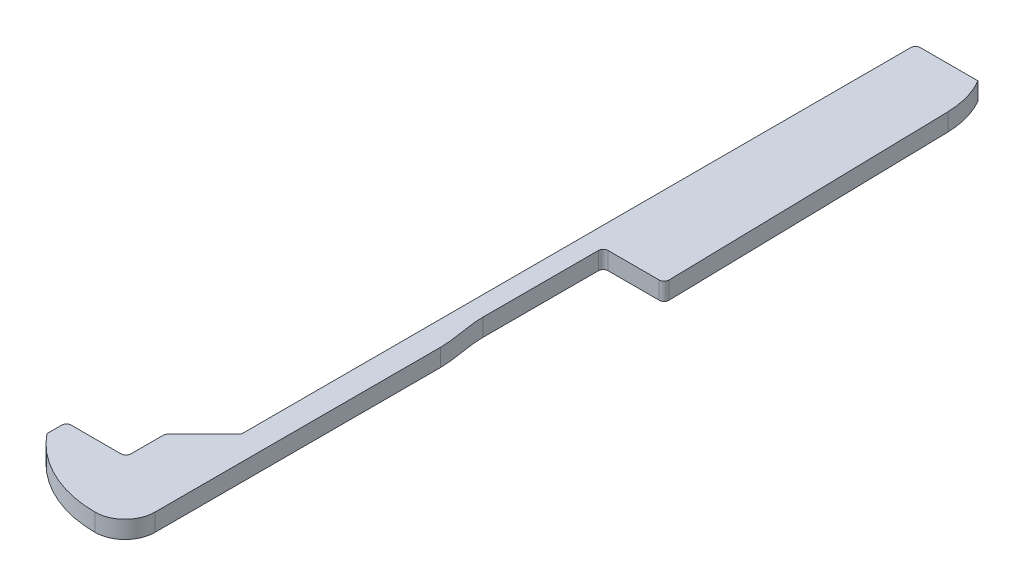
ISO-10303-21;
HEADER;
FILE_DESCRIPTION(('STEP AP214'),'2;1');
FILE_NAME('part.step','',(''),(''),'','','');
FILE_SCHEMA(('AUTOMOTIVE_DESIGN { 1 0 10303 214 1 1 1 1 }'));
ENDSEC;
DATA;
#1=APPLICATION_CONTEXT('core data for automotive mechanical design processes');
#2=APPLICATION_PROTOCOL_DEFINITION('international standard','automotive_design',2000,#1);
#3=PRODUCT_CONTEXT('',#1,'mechanical');
#4=PRODUCT('Part','Part','',(#3));
#5=PRODUCT_RELATED_PRODUCT_CATEGORY('part','',(#4));
#6=PRODUCT_DEFINITION_FORMATION('','',#4);
#7=PRODUCT_DEFINITION_CONTEXT('part definition',#1,'design');
#8=PRODUCT_DEFINITION('design','',#6,#7);
#9=PRODUCT_DEFINITION_SHAPE('','',#8);
#10=(LENGTH_UNIT() NAMED_UNIT(*) SI_UNIT(.MILLI.,.METRE.));
#11=(NAMED_UNIT(*) PLANE_ANGLE_UNIT() SI_UNIT($,.RADIAN.));
#12=(NAMED_UNIT(*) SI_UNIT($,.STERADIAN.) SOLID_ANGLE_UNIT());
#13=UNCERTAINTY_MEASURE_WITH_UNIT(LENGTH_MEASURE(1.E-05),#10,'distance_accuracy_value','');
#14=(GEOMETRIC_REPRESENTATION_CONTEXT(3) GLOBAL_UNCERTAINTY_ASSIGNED_CONTEXT((#13)) GLOBAL_UNIT_ASSIGNED_CONTEXT((#10,
#11,#12)) REPRESENTATION_CONTEXT('',''));
#15=CARTESIAN_POINT('',(0.,0.,0.));
#16=DIRECTION('',(0.,0.,1.));
#17=DIRECTION('',(1.,0.,0.));
#18=AXIS2_PLACEMENT_3D('',#15,#16,#17);
#19=CARTESIAN_POINT('',(9.43,1.8,-12.1305444444443));
#20=DIRECTION('',(0.,-1.,0.));
#21=DIRECTION('',(0.,0.,-1.));
#22=AXIS2_PLACEMENT_3D('',#19,#20,#21);
#23=CYLINDRICAL_SURFACE('',#22,12.1305444444443);
#24=CARTESIAN_POINT('',(9.43,0.,-12.1305444444443));
#25=DIRECTION('',(0.,1.,0.));
#26=DIRECTION('',(0.,0.,-1.));
#27=AXIS2_PLACEMENT_3D('',#24,#25,#26);
#28=CIRCLE('',#27,12.1305444444443);
#29=CARTESIAN_POINT('',(0.,0.,-4.5));
#30=VERTEX_POINT('',#29);
#31=CARTESIAN_POINT('',(9.43,0.,0.));
#32=VERTEX_POINT('',#31);
#33=EDGE_CURVE('E198',#30,#32,#28,.T.);
#34=ORIENTED_EDGE('',*,*,#33,.T.);
#35=DIRECTION('',(0.,-1.,0.));
#36=VECTOR('',#35,1.);
#37=CARTESIAN_POINT('',(9.43,1.8,0.));
#38=LINE('',#37,#36);
#39=CARTESIAN_POINT('',(9.43,1.8,0.));
#40=VERTEX_POINT('',#39);
#41=EDGE_CURVE('E180',#40,#32,#38,.T.);
#42=ORIENTED_EDGE('',*,*,#41,.F.);
#43=CARTESIAN_POINT('',(9.43,1.8,-12.1305444444443));
#44=DIRECTION('',(0.,1.,0.));
#45=DIRECTION('',(0.,0.,-1.));
#46=AXIS2_PLACEMENT_3D('',#43,#44,#45);
#47=CIRCLE('',#46,12.1305444444443);
#48=CARTESIAN_POINT('',(0.,1.8,-4.5));
#49=VERTEX_POINT('',#48);
#50=EDGE_CURVE('E186',#49,#40,#47,.T.);
#51=ORIENTED_EDGE('',*,*,#50,.F.);
#52=DIRECTION('',(0.,-1.,0.));
#53=VECTOR('',#52,1.);
#54=CARTESIAN_POINT('',(0.,1.8,-4.5));
#55=LINE('',#54,#53);
#56=EDGE_CURVE('E284',#49,#30,#55,.T.);
#57=ORIENTED_EDGE('',*,*,#56,.T.);
#58=EDGE_LOOP('',(#34,#42,#51,#57));
#59=FACE_BOUND('',#58,.T.);
#60=ADVANCED_FACE('F32',(#59),#23,.T.);
#61=CARTESIAN_POINT('',(9.43,1.8,-3.07));
#62=DIRECTION('',(0.,-1.,0.));
#63=DIRECTION('',(0.,0.,-1.));
#64=AXIS2_PLACEMENT_3D('',#61,#62,#63);
#65=CYLINDRICAL_SURFACE('',#64,3.07);
#66=CARTESIAN_POINT('',(9.43,0.,-3.07));
#67=DIRECTION('',(0.,1.,0.));
#68=DIRECTION('',(0.,0.,-1.));
#69=AXIS2_PLACEMENT_3D('',#66,#67,#68);
#70=CIRCLE('',#69,3.07);
#71=CARTESIAN_POINT('',(12.5,0.,-3.07));
#72=VERTEX_POINT('',#71);
#73=EDGE_CURVE('E291',#32,#72,#70,.T.);
#74=ORIENTED_EDGE('',*,*,#73,.T.);
#75=DIRECTION('',(0.,-1.,0.));
#76=VECTOR('',#75,1.);
#77=CARTESIAN_POINT('',(12.5,1.8,-3.07));
#78=LINE('',#77,#76);
#79=CARTESIAN_POINT('',(12.5,1.8,-3.07));
#80=VERTEX_POINT('',#79);
#81=EDGE_CURVE('E183',#80,#72,#78,.T.);
#82=ORIENTED_EDGE('',*,*,#81,.F.);
#83=CARTESIAN_POINT('',(9.43,1.8,-3.07));
#84=DIRECTION('',(0.,1.,0.));
#85=DIRECTION('',(0.,0.,-1.));
#86=AXIS2_PLACEMENT_3D('',#83,#84,#85);
#87=CIRCLE('',#86,3.07);
#88=EDGE_CURVE('E176',#40,#80,#87,.T.);
#89=ORIENTED_EDGE('',*,*,#88,.F.);
#90=ORIENTED_EDGE('',*,*,#41,.T.);
#91=EDGE_LOOP('',(#74,#82,#89,#90));
#92=FACE_BOUND('',#91,.T.);
#93=ADVANCED_FACE('F178',(#92),#65,.T.);
#94=CARTESIAN_POINT('',(12.5,1.8,-32.33));
#95=DIRECTION('',(-1.,0.,0.));
#96=DIRECTION('',(0.,0.,1.));
#97=AXIS2_PLACEMENT_3D('',#94,#95,#96);
#98=PLANE('',#97);
#99=DIRECTION('',(0.,0.,-1.));
#100=VECTOR('',#99,1.);
#101=CARTESIAN_POINT('',(12.5,0.,-32.33));
#102=LINE('',#101,#100);
#103=CARTESIAN_POINT('',(12.5,0.,-32.33));
#104=VERTEX_POINT('',#103);
#105=EDGE_CURVE('E293',#72,#104,#102,.T.);
#106=ORIENTED_EDGE('',*,*,#105,.T.);
#107=DIRECTION('',(0.,-1.,0.));
#108=VECTOR('',#107,1.);
#109=CARTESIAN_POINT('',(12.5,1.8,-32.33));
#110=LINE('',#109,#108);
#111=CARTESIAN_POINT('',(12.5,1.8,-32.33));
#112=VERTEX_POINT('',#111);
#113=EDGE_CURVE('E203',#112,#104,#110,.T.);
#114=ORIENTED_EDGE('',*,*,#113,.F.);
#115=DIRECTION('',(0.,0.,-1.));
#116=VECTOR('',#115,1.);
#117=CARTESIAN_POINT('',(12.5,1.8,-32.33));
#118=LINE('',#117,#116);
#119=EDGE_CURVE('E185',#80,#112,#118,.T.);
#120=ORIENTED_EDGE('',*,*,#119,.F.);
#121=ORIENTED_EDGE('',*,*,#81,.T.);
#122=EDGE_LOOP('',(#106,#114,#120,#121));
#123=FACE_BOUND('',#122,.T.);
#124=ADVANCED_FACE('F424',(#123),#98,.F.);
#125=CARTESIAN_POINT('',(12.5,1.8,-32.33));
#126=CARTESIAN_POINT('',(12.5,1.8,-33.9722823380889));
#127=CARTESIAN_POINT('',(12.,1.8,-35.554764974261));
#128=CARTESIAN_POINT('',(12.,1.8,-37.18));
#129=B_SPLINE_CURVE_WITH_KNOTS('',3,(#125,#126,#127,#128),.UNSPECIFIED.,.F.,.F.,(4,4),(0.,1.),.UNSPECIFIED.);
#130=DIRECTION('',(0.,-1.,0.));
#131=VECTOR('',#130,1.);
#132=SURFACE_OF_LINEAR_EXTRUSION('',#129,#131);
#133=CARTESIAN_POINT('',(12.5,0.,-32.33));
#134=CARTESIAN_POINT('',(12.5,0.,-33.9722823380889));
#135=CARTESIAN_POINT('',(12.,0.,-35.554764974261));
#136=CARTESIAN_POINT('',(12.,0.,-37.18));
#137=B_SPLINE_CURVE_WITH_KNOTS('',3,(#133,#134,#135,#136),.UNSPECIFIED.,.F.,.F.,(4,4),(0.,1.),.UNSPECIFIED.);
#138=CARTESIAN_POINT('',(12.,0.,-37.18));
#139=VERTEX_POINT('',#138);
#140=EDGE_CURVE('E295',#104,#139,#137,.T.);
#141=ORIENTED_EDGE('',*,*,#140,.T.);
#142=DIRECTION('',(0.,-1.,0.));
#143=VECTOR('',#142,1.);
#144=CARTESIAN_POINT('',(12.,1.8,-37.18));
#145=LINE('',#144,#143);
#146=CARTESIAN_POINT('',(12.,1.8,-37.18));
#147=VERTEX_POINT('',#146);
#148=EDGE_CURVE('E329',#147,#139,#145,.T.);
#149=ORIENTED_EDGE('',*,*,#148,.F.);
#150=EDGE_CURVE('E338',#112,#147,#129,.T.);
#151=ORIENTED_EDGE('',*,*,#150,.F.);
#152=ORIENTED_EDGE('',*,*,#113,.T.);
#153=EDGE_LOOP('',(#141,#149,#151,#152));
#154=FACE_BOUND('',#153,.T.);
#155=ADVANCED_FACE('F336',(#154),#132,.F.);
#156=CARTESIAN_POINT('',(12.,1.8,-37.18));
#157=DIRECTION('',(-1.,0.,0.));
#158=DIRECTION('',(0.,0.,1.));
#159=AXIS2_PLACEMENT_3D('',#156,#157,#158);
#160=PLANE('',#159);
#161=DIRECTION('',(0.,0.,-1.));
#162=VECTOR('',#161,1.);
#163=CARTESIAN_POINT('',(12.,0.,-37.18));
#164=LINE('',#163,#162);
#165=CARTESIAN_POINT('',(12.,0.,-49.));
#166=VERTEX_POINT('',#165);
#167=EDGE_CURVE('E299',#139,#166,#164,.T.);
#168=ORIENTED_EDGE('',*,*,#167,.T.);
#169=DIRECTION('',(0.,-1.,0.));
#170=VECTOR('',#169,1.);
#171=CARTESIAN_POINT('',(12.,1.8,-49.));
#172=LINE('',#171,#170);
#173=CARTESIAN_POINT('',(12.,1.8,-49.));
#174=VERTEX_POINT('',#173);
#175=EDGE_CURVE('E209',#166,#174,#172,.F.);
#176=ORIENTED_EDGE('',*,*,#175,.T.);
#177=DIRECTION('',(0.,0.,-1.));
#178=VECTOR('',#177,1.);
#179=CARTESIAN_POINT('',(12.,1.8,-37.18));
#180=LINE('',#179,#178);
#181=EDGE_CURVE('E355',#147,#174,#180,.T.);
#182=ORIENTED_EDGE('',*,*,#181,.F.);
#183=ORIENTED_EDGE('',*,*,#148,.T.);
#184=EDGE_LOOP('',(#168,#176,#182,#183));
#185=FACE_BOUND('',#184,.T.);
#186=ADVANCED_FACE('F345',(#185),#160,.F.);
#187=CARTESIAN_POINT('',(18.25,1.8,-49.5));
#188=DIRECTION('',(0.,0.,-1.));
#189=DIRECTION('',(-1.,0.,0.));
#190=AXIS2_PLACEMENT_3D('',#187,#188,#189);
#191=PLANE('',#190);
#192=DIRECTION('',(1.,0.,0.));
#193=VECTOR('',#192,1.);
#194=CARTESIAN_POINT('',(18.25,1.8,-49.5));
#195=LINE('',#194,#193);
#196=CARTESIAN_POINT('',(12.5,1.8,-49.5));
#197=VERTEX_POINT('',#196);
#198=CARTESIAN_POINT('',(17.7389709464066,1.8,-49.5));
#199=VERTEX_POINT('',#198);
#200=EDGE_CURVE('E353',#197,#199,#195,.T.);
#201=ORIENTED_EDGE('',*,*,#200,.F.);
#202=DIRECTION('',(0.,-1.,0.));
#203=VECTOR('',#202,1.);
#204=CARTESIAN_POINT('',(12.5,0.,-49.5));
#205=LINE('',#204,#203);
#206=CARTESIAN_POINT('',(12.5,0.,-49.5));
#207=VERTEX_POINT('',#206);
#208=EDGE_CURVE('E201',#197,#207,#205,.T.);
#209=ORIENTED_EDGE('',*,*,#208,.T.);
#210=DIRECTION('',(1.,0.,0.));
#211=VECTOR('',#210,1.);
#212=CARTESIAN_POINT('',(18.25,0.,-49.5));
#213=LINE('',#212,#211);
#214=CARTESIAN_POINT('',(17.7389709464066,0.,-49.5));
#215=VERTEX_POINT('',#214);
#216=EDGE_CURVE('E305',#207,#215,#213,.T.);
#217=ORIENTED_EDGE('',*,*,#216,.T.);
#218=DIRECTION('',(0.,-1.,0.));
#219=VECTOR('',#218,1.);
#220=CARTESIAN_POINT('',(17.7389709464066,1.8,-49.5));
#221=LINE('',#220,#219);
#222=EDGE_CURVE('E199',#215,#199,#221,.F.);
#223=ORIENTED_EDGE('',*,*,#222,.T.);
#224=EDGE_LOOP('',(#201,#209,#217,#223));
#225=FACE_BOUND('',#224,.T.);
#226=ADVANCED_FACE('F357',(#225),#191,.F.);
#227=CARTESIAN_POINT('',(17.6019605823982,1.8,-79.1992260441899));
#228=DIRECTION('',(-0.999762027079909,0.,0.0218148850345542));
#229=DIRECTION('',(0.0218148850345542,0.,0.999762027079909));
#230=AXIS2_PLACEMENT_3D('',#227,#228,#229);
#231=PLANE('',#230);
#232=DIRECTION('',(-0.0218148850345542,0.,-0.999762027079909));
#233=VECTOR('',#232,1.);
#234=CARTESIAN_POINT('',(17.6019605823982,1.8,-79.1992260441899));
#235=LINE('',#234,#233);
#236=CARTESIAN_POINT('',(18.2388519599465,1.8,-50.0109074425173));
#237=VERTEX_POINT('',#236);
#238=CARTESIAN_POINT('',(17.6019605823982,1.8,-79.1992260441899));
#239=VERTEX_POINT('',#238);
#240=EDGE_CURVE('E359',#237,#239,#235,.T.);
#241=ORIENTED_EDGE('',*,*,#240,.F.);
#242=DIRECTION('',(0.,-1.,0.));
#243=VECTOR('',#242,1.);
#244=CARTESIAN_POINT('',(18.2388519599465,1.8,-50.0109074425173));
#245=LINE('',#244,#243);
#246=CARTESIAN_POINT('',(18.2388519599465,0.,-50.0109074425173));
#247=VERTEX_POINT('',#246);
#248=EDGE_CURVE('E211',#237,#247,#245,.T.);
#249=ORIENTED_EDGE('',*,*,#248,.T.);
#250=DIRECTION('',(-0.0218148850345542,0.,-0.999762027079909));
#251=VECTOR('',#250,1.);
#252=CARTESIAN_POINT('',(17.6019605823982,0.,-79.1992260441899));
#253=LINE('',#252,#251);
#254=CARTESIAN_POINT('',(17.6019605823982,0.,-79.1992260441899));
#255=VERTEX_POINT('',#254);
#256=EDGE_CURVE('E308',#247,#255,#253,.T.);
#257=ORIENTED_EDGE('',*,*,#256,.T.);
#258=DIRECTION('',(0.,-1.,0.));
#259=VECTOR('',#258,1.);
#260=CARTESIAN_POINT('',(17.6019605823982,1.8,-79.1992260441899));
#261=LINE('',#260,#259);
#262=EDGE_CURVE('E326',#239,#255,#261,.T.);
#263=ORIENTED_EDGE('',*,*,#262,.F.);
#264=EDGE_LOOP('',(#241,#249,#257,#263));
#265=FACE_BOUND('',#264,.T.);
#266=ADVANCED_FACE('F407',(#265),#231,.F.);
#267=CARTESIAN_POINT('',(8.60410233867904,1.8,-79.0028920788789));
#268=DIRECTION('',(0.,-1.,0.));
#269=DIRECTION('',(0.,0.,-1.));
#270=AXIS2_PLACEMENT_3D('',#267,#268,#269);
#271=CYLINDRICAL_SURFACE('',#270,9.);
#272=CARTESIAN_POINT('',(8.60410233867904,0.,-79.0028920788789));
#273=DIRECTION('',(0.,1.,0.));
#274=DIRECTION('',(0.,0.,1.));
#275=AXIS2_PLACEMENT_3D('',#272,#273,#274);
#276=CIRCLE('',#275,9.);
#277=CARTESIAN_POINT('',(16.4,0.,-83.5));
#278=VERTEX_POINT('',#277);
#279=EDGE_CURVE('E310',#255,#278,#276,.T.);
#280=ORIENTED_EDGE('',*,*,#279,.T.);
#281=DIRECTION('',(0.,-1.,0.));
#282=VECTOR('',#281,1.);
#283=CARTESIAN_POINT('',(16.4,1.8,-83.5));
#284=LINE('',#283,#282);
#285=CARTESIAN_POINT('',(16.4,1.8,-83.5));
#286=VERTEX_POINT('',#285);
#287=EDGE_CURVE('E323',#286,#278,#284,.T.);
#288=ORIENTED_EDGE('',*,*,#287,.F.);
#289=CARTESIAN_POINT('',(8.60410233867904,1.8,-79.0028920788789));
#290=DIRECTION('',(0.,1.,0.));
#291=DIRECTION('',(0.,0.,1.));
#292=AXIS2_PLACEMENT_3D('',#289,#290,#291);
#293=CIRCLE('',#292,9.);
#294=EDGE_CURVE('E361',#239,#286,#293,.T.);
#295=ORIENTED_EDGE('',*,*,#294,.F.);
#296=ORIENTED_EDGE('',*,*,#262,.T.);
#297=EDGE_LOOP('',(#280,#288,#295,#296));
#298=FACE_BOUND('',#297,.T.);
#299=ADVANCED_FACE('F403',(#298),#271,.T.);
#300=CARTESIAN_POINT('',(10.,1.8,-83.5));
#301=DIRECTION('',(0.,0.,1.));
#302=DIRECTION('',(1.,0.,0.));
#303=AXIS2_PLACEMENT_3D('',#300,#301,#302);
#304=PLANE('',#303);
#305=DIRECTION('',(-1.,0.,0.));
#306=VECTOR('',#305,1.);
#307=CARTESIAN_POINT('',(10.,0.,-83.5));
#308=LINE('',#307,#306);
#309=CARTESIAN_POINT('',(10.5,0.,-83.5));
#310=VERTEX_POINT('',#309);
#311=EDGE_CURVE('E312',#278,#310,#308,.T.);
#312=ORIENTED_EDGE('',*,*,#311,.T.);
#313=DIRECTION('',(0.,-1.,0.));
#314=VECTOR('',#313,1.);
#315=CARTESIAN_POINT('',(10.5,1.8,-83.5));
#316=LINE('',#315,#314);
#317=CARTESIAN_POINT('',(10.5,1.8,-83.5));
#318=VERTEX_POINT('',#317);
#319=EDGE_CURVE('E248',#310,#318,#316,.F.);
#320=ORIENTED_EDGE('',*,*,#319,.T.);
#321=DIRECTION('',(-1.,0.,0.));
#322=VECTOR('',#321,1.);
#323=CARTESIAN_POINT('',(10.,1.8,-83.5));
#324=LINE('',#323,#322);
#325=EDGE_CURVE('E367',#286,#318,#324,.T.);
#326=ORIENTED_EDGE('',*,*,#325,.F.);
#327=ORIENTED_EDGE('',*,*,#287,.T.);
#328=EDGE_LOOP('',(#312,#320,#326,#327));
#329=FACE_BOUND('',#328,.T.);
#330=ADVANCED_FACE('F398',(#329),#304,.F.);
#331=CARTESIAN_POINT('',(10.,1.8,-14.4));
#332=DIRECTION('',(1.,0.,0.));
#333=DIRECTION('',(0.,0.,-1.));
#334=AXIS2_PLACEMENT_3D('',#331,#332,#333);
#335=PLANE('',#334);
#336=DIRECTION('',(0.,0.,1.));
#337=VECTOR('',#336,1.);
#338=CARTESIAN_POINT('',(10.,0.,-14.4));
#339=LINE('',#338,#337);
#340=CARTESIAN_POINT('',(10.,0.,-83.));
#341=VERTEX_POINT('',#340);
#342=CARTESIAN_POINT('',(10.,0.,-14.6071067811865));
#343=VERTEX_POINT('',#342);
#344=EDGE_CURVE('E315',#341,#343,#339,.T.);
#345=ORIENTED_EDGE('',*,*,#344,.T.);
#346=DIRECTION('',(0.,-1.,0.));
#347=VECTOR('',#346,1.);
#348=CARTESIAN_POINT('',(10.,1.8,-14.6071067811865));
#349=LINE('',#348,#347);
#350=CARTESIAN_POINT('',(10.,1.8,-14.6071067811865));
#351=VERTEX_POINT('',#350);
#352=EDGE_CURVE('E237',#343,#351,#349,.F.);
#353=ORIENTED_EDGE('',*,*,#352,.T.);
#354=DIRECTION('',(0.,0.,1.));
#355=VECTOR('',#354,1.);
#356=CARTESIAN_POINT('',(10.,1.8,-14.4));
#357=LINE('',#356,#355);
#358=CARTESIAN_POINT('',(10.,1.8,-83.));
#359=VERTEX_POINT('',#358);
#360=EDGE_CURVE('E370',#359,#351,#357,.T.);
#361=ORIENTED_EDGE('',*,*,#360,.F.);
#362=DIRECTION('',(0.,-1.,0.));
#363=VECTOR('',#362,1.);
#364=CARTESIAN_POINT('',(10.,1.8,-83.));
#365=LINE('',#364,#363);
#366=EDGE_CURVE('E234',#359,#341,#365,.T.);
#367=ORIENTED_EDGE('',*,*,#366,.T.);
#368=EDGE_LOOP('',(#345,#353,#361,#367));
#369=FACE_BOUND('',#368,.T.);
#370=ADVANCED_FACE('F388',(#369),#335,.F.);
#371=CARTESIAN_POINT('',(6.1,1.8,-10.5));
#372=DIRECTION('',(0.707106781186546,0.,0.707106781186549));
#373=DIRECTION('',(0.707106781186549,0.,-0.707106781186546));
#374=AXIS2_PLACEMENT_3D('',#371,#372,#373);
#375=PLANE('',#374);
#376=DIRECTION('',(-0.707106781186549,0.,0.707106781186546));
#377=VECTOR('',#376,1.);
#378=CARTESIAN_POINT('',(6.1,1.8,-10.5));
#379=LINE('',#378,#377);
#380=CARTESIAN_POINT('',(9.85355339059327,1.8,-14.2535533905933));
#381=VERTEX_POINT('',#380);
#382=CARTESIAN_POINT('',(6.24644660940673,1.8,-10.6464466094067));
#383=VERTEX_POINT('',#382);
#384=EDGE_CURVE('E286',#381,#383,#379,.T.);
#385=ORIENTED_EDGE('',*,*,#384,.F.);
#386=DIRECTION('',(0.,-1.,0.));
#387=VECTOR('',#386,1.);
#388=CARTESIAN_POINT('',(9.85355339059327,0.,-14.2535533905933));
#389=LINE('',#388,#387);
#390=CARTESIAN_POINT('',(9.85355339059327,0.,-14.2535533905933));
#391=VERTEX_POINT('',#390);
#392=EDGE_CURVE('E231',#381,#391,#389,.T.);
#393=ORIENTED_EDGE('',*,*,#392,.T.);
#394=DIRECTION('',(-0.707106781186549,0.,0.707106781186546));
#395=VECTOR('',#394,1.);
#396=CARTESIAN_POINT('',(6.1,0.,-10.5));
#397=LINE('',#396,#395);
#398=CARTESIAN_POINT('',(6.24644660940673,0.,-10.6464466094067));
#399=VERTEX_POINT('',#398);
#400=EDGE_CURVE('E276',#391,#399,#397,.T.);
#401=ORIENTED_EDGE('',*,*,#400,.T.);
#402=DIRECTION('',(0.,-1.,0.));
#403=VECTOR('',#402,1.);
#404=CARTESIAN_POINT('',(6.24644660940673,1.8,-10.6464466094067));
#405=LINE('',#404,#403);
#406=EDGE_CURVE('E229',#399,#383,#405,.F.);
#407=ORIENTED_EDGE('',*,*,#406,.T.);
#408=EDGE_LOOP('',(#385,#393,#401,#407));
#409=FACE_BOUND('',#408,.T.);
#410=ADVANCED_FACE('F382',(#409),#375,.F.);
#411=CARTESIAN_POINT('',(6.1,1.8,-6.5));
#412=DIRECTION('',(1.,0.,0.));
#413=DIRECTION('',(0.,0.,-1.));
#414=AXIS2_PLACEMENT_3D('',#411,#412,#413);
#415=PLANE('',#414);
#416=DIRECTION('',(0.,0.,1.));
#417=VECTOR('',#416,1.);
#418=CARTESIAN_POINT('',(6.1,1.8,-6.5));
#419=LINE('',#418,#417);
#420=CARTESIAN_POINT('',(6.1,1.8,-10.2928932188135));
#421=VERTEX_POINT('',#420);
#422=CARTESIAN_POINT('',(6.1,1.8,-7.));
#423=VERTEX_POINT('',#422);
#424=EDGE_CURVE('E281',#421,#423,#419,.T.);
#425=ORIENTED_EDGE('',*,*,#424,.F.);
#426=DIRECTION('',(0.,-1.,0.));
#427=VECTOR('',#426,1.);
#428=CARTESIAN_POINT('',(6.1,1.8,-10.2928932188135));
#429=LINE('',#428,#427);
#430=CARTESIAN_POINT('',(6.1,0.,-10.2928932188135));
#431=VERTEX_POINT('',#430);
#432=EDGE_CURVE('E241',#421,#431,#429,.T.);
#433=ORIENTED_EDGE('',*,*,#432,.T.);
#434=DIRECTION('',(0.,0.,1.));
#435=VECTOR('',#434,1.);
#436=CARTESIAN_POINT('',(6.1,0.,-6.5));
#437=LINE('',#436,#435);
#438=CARTESIAN_POINT('',(6.1,0.,-7.));
#439=VERTEX_POINT('',#438);
#440=EDGE_CURVE('E266',#431,#439,#437,.T.);
#441=ORIENTED_EDGE('',*,*,#440,.T.);
#442=DIRECTION('',(0.,-1.,0.));
#443=VECTOR('',#442,1.);
#444=CARTESIAN_POINT('',(6.1,1.8,-7.));
#445=LINE('',#444,#443);
#446=EDGE_CURVE('E239',#439,#423,#445,.F.);
#447=ORIENTED_EDGE('',*,*,#446,.T.);
#448=EDGE_LOOP('',(#425,#433,#441,#447));
#449=FACE_BOUND('',#448,.T.);
#450=ADVANCED_FACE('F273',(#449),#415,.F.);
#451=CARTESIAN_POINT('',(0.,1.8,-6.5));
#452=DIRECTION('',(0.,0.,1.));
#453=DIRECTION('',(1.,0.,0.));
#454=AXIS2_PLACEMENT_3D('',#451,#452,#453);
#455=PLANE('',#454);
#456=DIRECTION('',(-1.,0.,0.));
#457=VECTOR('',#456,1.);
#458=CARTESIAN_POINT('',(0.,1.8,-6.5));
#459=LINE('',#458,#457);
#460=CARTESIAN_POINT('',(5.6,1.8,-6.5));
#461=VERTEX_POINT('',#460);
#462=CARTESIAN_POINT('',(0.5,1.8,-6.5));
#463=VERTEX_POINT('',#462);
#464=EDGE_CURVE('E280',#461,#463,#459,.T.);
#465=ORIENTED_EDGE('',*,*,#464,.F.);
#466=DIRECTION('',(0.,-1.,0.));
#467=VECTOR('',#466,1.);
#468=CARTESIAN_POINT('',(5.6,0.,-6.5));
#469=LINE('',#468,#467);
#470=CARTESIAN_POINT('',(5.6,0.,-6.5));
#471=VERTEX_POINT('',#470);
#472=EDGE_CURVE('E245',#461,#471,#469,.T.);
#473=ORIENTED_EDGE('',*,*,#472,.T.);
#474=DIRECTION('',(-1.,0.,0.));
#475=VECTOR('',#474,1.);
#476=CARTESIAN_POINT('',(0.,0.,-6.5));
#477=LINE('',#476,#475);
#478=CARTESIAN_POINT('',(0.5,0.,-6.5));
#479=VERTEX_POINT('',#478);
#480=EDGE_CURVE('E267',#471,#479,#477,.T.);
#481=ORIENTED_EDGE('',*,*,#480,.T.);
#482=DIRECTION('',(0.,-1.,0.));
#483=VECTOR('',#482,1.);
#484=CARTESIAN_POINT('',(0.5,1.8,-6.5));
#485=LINE('',#484,#483);
#486=EDGE_CURVE('E55',#479,#463,#485,.F.);
#487=ORIENTED_EDGE('',*,*,#486,.T.);
#488=EDGE_LOOP('',(#465,#473,#481,#487));
#489=FACE_BOUND('',#488,.T.);
#490=ADVANCED_FACE('F282',(#489),#455,.F.);
#491=CARTESIAN_POINT('',(0.,1.8,-4.5));
#492=DIRECTION('',(1.,0.,0.));
#493=DIRECTION('',(0.,0.,-1.));
#494=AXIS2_PLACEMENT_3D('',#491,#492,#493);
#495=PLANE('',#494);
#496=DIRECTION('',(0.,0.,1.));
#497=VECTOR('',#496,1.);
#498=CARTESIAN_POINT('',(0.,1.8,-4.5));
#499=LINE('',#498,#497);
#500=CARTESIAN_POINT('',(0.,1.8,-6.));
#501=VERTEX_POINT('',#500);
#502=EDGE_CURVE('E191',#501,#49,#499,.T.);
#503=ORIENTED_EDGE('',*,*,#502,.F.);
#504=DIRECTION('',(0.,-1.,0.));
#505=VECTOR('',#504,1.);
#506=CARTESIAN_POINT('',(0.,1.8,-6.));
#507=LINE('',#506,#505);
#508=CARTESIAN_POINT('',(0.,0.,-6.));
#509=VERTEX_POINT('',#508);
#510=EDGE_CURVE('E250',#501,#509,#507,.T.);
#511=ORIENTED_EDGE('',*,*,#510,.T.);
#512=DIRECTION('',(0.,0.,1.));
#513=VECTOR('',#512,1.);
#514=CARTESIAN_POINT('',(0.,0.,-4.5));
#515=LINE('',#514,#513);
#516=EDGE_CURVE('E195',#509,#30,#515,.T.);
#517=ORIENTED_EDGE('',*,*,#516,.T.);
#518=ORIENTED_EDGE('',*,*,#56,.F.);
#519=EDGE_LOOP('',(#503,#511,#517,#518));
#520=FACE_BOUND('',#519,.T.);
#521=ADVANCED_FACE('F456',(#520),#495,.F.);
#522=CARTESIAN_POINT('',(9.43,1.8,-12.1305444444443));
#523=DIRECTION('',(0.,-1.,0.));
#524=DIRECTION('',(0.,0.,-1.));
#525=AXIS2_PLACEMENT_3D('',#522,#523,#524);
#526=PLANE('',#525);
#527=ORIENTED_EDGE('',*,*,#200,.T.);
#528=CARTESIAN_POINT('',(17.7389709464066,1.8,-50.));
#529=DIRECTION('',(0.,-1.,0.));
#530=DIRECTION('',(0.,0.,-1.));
#531=AXIS2_PLACEMENT_3D('',#528,#529,#530);
#532=CIRCLE('',#531,0.5);
#533=EDGE_CURVE('E227',#199,#237,#532,.F.);
#534=ORIENTED_EDGE('',*,*,#533,.T.);
#535=ORIENTED_EDGE('',*,*,#240,.T.);
#536=ORIENTED_EDGE('',*,*,#294,.T.);
#537=ORIENTED_EDGE('',*,*,#325,.T.);
#538=CARTESIAN_POINT('',(10.5,1.8,-83.));
#539=DIRECTION('',(0.,-1.,0.));
#540=DIRECTION('',(0.,0.,-1.));
#541=AXIS2_PLACEMENT_3D('',#538,#539,#540);
#542=CIRCLE('',#541,0.5);
#543=EDGE_CURVE('E223',#318,#359,#542,.F.);
#544=ORIENTED_EDGE('',*,*,#543,.T.);
#545=ORIENTED_EDGE('',*,*,#360,.T.);
#546=CARTESIAN_POINT('',(9.5,1.8,-14.6071067811865));
#547=DIRECTION('',(0.,-1.,0.));
#548=DIRECTION('',(0.,0.,-1.));
#549=AXIS2_PLACEMENT_3D('',#546,#547,#548);
#550=CIRCLE('',#549,0.5);
#551=EDGE_CURVE('E259',#351,#381,#550,.T.);
#552=ORIENTED_EDGE('',*,*,#551,.T.);
#553=ORIENTED_EDGE('',*,*,#384,.T.);
#554=CARTESIAN_POINT('',(6.6,1.8,-10.2928932188135));
#555=DIRECTION('',(0.,-1.,0.));
#556=DIRECTION('',(0.,0.,-1.));
#557=AXIS2_PLACEMENT_3D('',#554,#555,#556);
#558=CIRCLE('',#557,0.5);
#559=EDGE_CURVE('E225',#383,#421,#558,.F.);
#560=ORIENTED_EDGE('',*,*,#559,.T.);
#561=ORIENTED_EDGE('',*,*,#424,.T.);
#562=CARTESIAN_POINT('',(5.6,1.8,-7.));
#563=DIRECTION('',(0.,-1.,0.));
#564=DIRECTION('',(0.,0.,-1.));
#565=AXIS2_PLACEMENT_3D('',#562,#563,#564);
#566=CIRCLE('',#565,0.5);
#567=EDGE_CURVE('E11',#423,#461,#566,.T.);
#568=ORIENTED_EDGE('',*,*,#567,.T.);
#569=ORIENTED_EDGE('',*,*,#464,.T.);
#570=CARTESIAN_POINT('',(0.5,1.8,-6.));
#571=DIRECTION('',(0.,-1.,0.));
#572=DIRECTION('',(0.,0.,-1.));
#573=AXIS2_PLACEMENT_3D('',#570,#571,#572);
#574=CIRCLE('',#573,0.5);
#575=EDGE_CURVE('E47',#463,#501,#574,.F.);
#576=ORIENTED_EDGE('',*,*,#575,.T.);
#577=ORIENTED_EDGE('',*,*,#502,.T.);
#578=ORIENTED_EDGE('',*,*,#50,.T.);
#579=ORIENTED_EDGE('',*,*,#88,.T.);
#580=ORIENTED_EDGE('',*,*,#119,.T.);
#581=ORIENTED_EDGE('',*,*,#150,.T.);
#582=ORIENTED_EDGE('',*,*,#181,.T.);
#583=CARTESIAN_POINT('',(12.5,1.8,-49.));
#584=DIRECTION('',(0.,-1.,0.));
#585=DIRECTION('',(0.,0.,-1.));
#586=AXIS2_PLACEMENT_3D('',#583,#584,#585);
#587=CIRCLE('',#586,0.5);
#588=EDGE_CURVE('E255',#174,#197,#587,.T.);
#589=ORIENTED_EDGE('',*,*,#588,.T.);
#590=EDGE_LOOP('',(#527,#534,#535,#536,#537,#544,#545,#552,#553,#560,#561,#568,#569,#576,#577,
#578,#579,#580,#581,#582,#589));
#591=FACE_BOUND('',#590,.T.);
#592=ADVANCED_FACE('F190',(#591),#526,.F.);
#593=CARTESIAN_POINT('',(9.43,0.,-12.1305444444443));
#594=DIRECTION('',(0.,-1.,0.));
#595=DIRECTION('',(0.,0.,-1.));
#596=AXIS2_PLACEMENT_3D('',#593,#594,#595);
#597=PLANE('',#596);
#598=ORIENTED_EDGE('',*,*,#256,.F.);
#599=CARTESIAN_POINT('',(17.7389709464066,0.,-50.));
#600=DIRECTION('',(0.,-1.,0.));
#601=DIRECTION('',(0.,0.,-1.));
#602=AXIS2_PLACEMENT_3D('',#599,#600,#601);
#603=CIRCLE('',#602,0.5);
#604=EDGE_CURVE('E220',#247,#215,#603,.T.);
#605=ORIENTED_EDGE('',*,*,#604,.T.);
#606=ORIENTED_EDGE('',*,*,#216,.F.);
#607=CARTESIAN_POINT('',(12.5,0.,-49.));
#608=DIRECTION('',(0.,-1.,0.));
#609=DIRECTION('',(0.,0.,-1.));
#610=AXIS2_PLACEMENT_3D('',#607,#608,#609);
#611=CIRCLE('',#610,0.5);
#612=EDGE_CURVE('E253',#207,#166,#611,.F.);
#613=ORIENTED_EDGE('',*,*,#612,.T.);
#614=ORIENTED_EDGE('',*,*,#167,.F.);
#615=ORIENTED_EDGE('',*,*,#140,.F.);
#616=ORIENTED_EDGE('',*,*,#105,.F.);
#617=ORIENTED_EDGE('',*,*,#73,.F.);
#618=ORIENTED_EDGE('',*,*,#33,.F.);
#619=ORIENTED_EDGE('',*,*,#516,.F.);
#620=CARTESIAN_POINT('',(0.5,0.,-6.));
#621=DIRECTION('',(0.,-1.,0.));
#622=DIRECTION('',(0.,0.,-1.));
#623=AXIS2_PLACEMENT_3D('',#620,#621,#622);
#624=CIRCLE('',#623,0.5);
#625=EDGE_CURVE('E214',#509,#479,#624,.T.);
#626=ORIENTED_EDGE('',*,*,#625,.T.);
#627=ORIENTED_EDGE('',*,*,#480,.F.);
#628=CARTESIAN_POINT('',(5.6,0.,-7.));
#629=DIRECTION('',(0.,-1.,0.));
#630=DIRECTION('',(0.,0.,-1.));
#631=AXIS2_PLACEMENT_3D('',#628,#629,#630);
#632=CIRCLE('',#631,0.5);
#633=EDGE_CURVE('E40',#471,#439,#632,.F.);
#634=ORIENTED_EDGE('',*,*,#633,.T.);
#635=ORIENTED_EDGE('',*,*,#440,.F.);
#636=CARTESIAN_POINT('',(6.6,0.,-10.2928932188135));
#637=DIRECTION('',(0.,-1.,0.));
#638=DIRECTION('',(0.,0.,-1.));
#639=AXIS2_PLACEMENT_3D('',#636,#637,#638);
#640=CIRCLE('',#639,0.5);
#641=EDGE_CURVE('E218',#431,#399,#640,.T.);
#642=ORIENTED_EDGE('',*,*,#641,.T.);
#643=ORIENTED_EDGE('',*,*,#400,.F.);
#644=CARTESIAN_POINT('',(9.5,0.,-14.6071067811865));
#645=DIRECTION('',(0.,-1.,0.));
#646=DIRECTION('',(0.,0.,-1.));
#647=AXIS2_PLACEMENT_3D('',#644,#645,#646);
#648=CIRCLE('',#647,0.5);
#649=EDGE_CURVE('E257',#391,#343,#648,.F.);
#650=ORIENTED_EDGE('',*,*,#649,.T.);
#651=ORIENTED_EDGE('',*,*,#344,.F.);
#652=CARTESIAN_POINT('',(10.5,0.,-83.));
#653=DIRECTION('',(0.,-1.,0.));
#654=DIRECTION('',(0.,0.,-1.));
#655=AXIS2_PLACEMENT_3D('',#652,#653,#654);
#656=CIRCLE('',#655,0.5);
#657=EDGE_CURVE('E216',#341,#310,#656,.T.);
#658=ORIENTED_EDGE('',*,*,#657,.T.);
#659=ORIENTED_EDGE('',*,*,#311,.F.);
#660=ORIENTED_EDGE('',*,*,#279,.F.);
#661=EDGE_LOOP('',(#598,#605,#606,#613,#614,#615,#616,#617,#618,#619,#626,#627,#634,#635,#642,
#643,#650,#651,#658,#659,#660));
#662=FACE_BOUND('',#661,.T.);
#663=ADVANCED_FACE('F265',(#662),#597,.T.);
#664=CARTESIAN_POINT('',(12.5,1.8,-49.));
#665=DIRECTION('',(0.,1.,0.));
#666=DIRECTION('',(0.,0.,1.));
#667=AXIS2_PLACEMENT_3D('',#664,#665,#666);
#668=CYLINDRICAL_SURFACE('',#667,0.5);
#669=ORIENTED_EDGE('',*,*,#588,.F.);
#670=ORIENTED_EDGE('',*,*,#175,.F.);
#671=ORIENTED_EDGE('',*,*,#612,.F.);
#672=ORIENTED_EDGE('',*,*,#208,.F.);
#673=EDGE_LOOP('',(#669,#670,#671,#672));
#674=FACE_BOUND('',#673,.T.);
#675=ADVANCED_FACE('F350',(#674),#668,.F.);
#676=CARTESIAN_POINT('',(17.7389709464066,1.8,-50.));
#677=DIRECTION('',(0.,-1.,0.));
#678=DIRECTION('',(0.,0.,-1.));
#679=AXIS2_PLACEMENT_3D('',#676,#677,#678);
#680=CYLINDRICAL_SURFACE('',#679,0.5);
#681=ORIENTED_EDGE('',*,*,#533,.F.);
#682=ORIENTED_EDGE('',*,*,#222,.F.);
#683=ORIENTED_EDGE('',*,*,#604,.F.);
#684=ORIENTED_EDGE('',*,*,#248,.F.);
#685=EDGE_LOOP('',(#681,#682,#683,#684));
#686=FACE_BOUND('',#685,.T.);
#687=ADVANCED_FACE('F410',(#686),#680,.T.);
#688=CARTESIAN_POINT('',(9.5,1.8,-14.6071067811865));
#689=DIRECTION('',(0.,1.,0.));
#690=DIRECTION('',(0.,0.,1.));
#691=AXIS2_PLACEMENT_3D('',#688,#689,#690);
#692=CYLINDRICAL_SURFACE('',#691,0.5);
#693=ORIENTED_EDGE('',*,*,#551,.F.);
#694=ORIENTED_EDGE('',*,*,#352,.F.);
#695=ORIENTED_EDGE('',*,*,#649,.F.);
#696=ORIENTED_EDGE('',*,*,#392,.F.);
#697=EDGE_LOOP('',(#693,#694,#695,#696));
#698=FACE_BOUND('',#697,.T.);
#699=ADVANCED_FACE('F384',(#698),#692,.F.);
#700=CARTESIAN_POINT('',(6.6,1.8,-10.2928932188135));
#701=DIRECTION('',(0.,-1.,0.));
#702=DIRECTION('',(0.,0.,-1.));
#703=AXIS2_PLACEMENT_3D('',#700,#701,#702);
#704=CYLINDRICAL_SURFACE('',#703,0.5);
#705=ORIENTED_EDGE('',*,*,#559,.F.);
#706=ORIENTED_EDGE('',*,*,#406,.F.);
#707=ORIENTED_EDGE('',*,*,#641,.F.);
#708=ORIENTED_EDGE('',*,*,#432,.F.);
#709=EDGE_LOOP('',(#705,#706,#707,#708));
#710=FACE_BOUND('',#709,.T.);
#711=ADVANCED_FACE('F380',(#710),#704,.T.);
#712=CARTESIAN_POINT('',(5.6,1.8,-7.));
#713=DIRECTION('',(0.,1.,0.));
#714=DIRECTION('',(0.,0.,1.));
#715=AXIS2_PLACEMENT_3D('',#712,#713,#714);
#716=CYLINDRICAL_SURFACE('',#715,0.5);
#717=ORIENTED_EDGE('',*,*,#567,.F.);
#718=ORIENTED_EDGE('',*,*,#446,.F.);
#719=ORIENTED_EDGE('',*,*,#633,.F.);
#720=ORIENTED_EDGE('',*,*,#472,.F.);
#721=EDGE_LOOP('',(#717,#718,#719,#720));
#722=FACE_BOUND('',#721,.T.);
#723=ADVANCED_FACE('F279',(#722),#716,.F.);
#724=CARTESIAN_POINT('',(10.5,1.8,-83.));
#725=DIRECTION('',(0.,-1.,0.));
#726=DIRECTION('',(0.,0.,-1.));
#727=AXIS2_PLACEMENT_3D('',#724,#725,#726);
#728=CYLINDRICAL_SURFACE('',#727,0.5);
#729=ORIENTED_EDGE('',*,*,#543,.F.);
#730=ORIENTED_EDGE('',*,*,#319,.F.);
#731=ORIENTED_EDGE('',*,*,#657,.F.);
#732=ORIENTED_EDGE('',*,*,#366,.F.);
#733=EDGE_LOOP('',(#729,#730,#731,#732));
#734=FACE_BOUND('',#733,.T.);
#735=ADVANCED_FACE('F393',(#734),#728,.T.);
#736=CARTESIAN_POINT('',(0.5,1.8,-6.));
#737=DIRECTION('',(0.,-1.,0.));
#738=DIRECTION('',(0.,0.,-1.));
#739=AXIS2_PLACEMENT_3D('',#736,#737,#738);
#740=CYLINDRICAL_SURFACE('',#739,0.5);
#741=ORIENTED_EDGE('',*,*,#575,.F.);
#742=ORIENTED_EDGE('',*,*,#486,.F.);
#743=ORIENTED_EDGE('',*,*,#625,.F.);
#744=ORIENTED_EDGE('',*,*,#510,.F.);
#745=EDGE_LOOP('',(#741,#742,#743,#744));
#746=FACE_BOUND('',#745,.T.);
#747=ADVANCED_FACE('F34',(#746),#740,.T.);
#748=CLOSED_SHELL('',(#60,#93,#124,#155,#186,#226,#266,#299,#330,#370,#410,#450,#490,#521,#592,
#663,#675,#687,#699,#711,#723,#735,#747));
#749=MANIFOLD_SOLID_BREP('B2',#748);
#750=ADVANCED_BREP_SHAPE_REPRESENTATION('',(#18,#749),#14);
#751=SHAPE_DEFINITION_REPRESENTATION(#9,#750);
ENDSEC;
END-ISO-10303-21;
